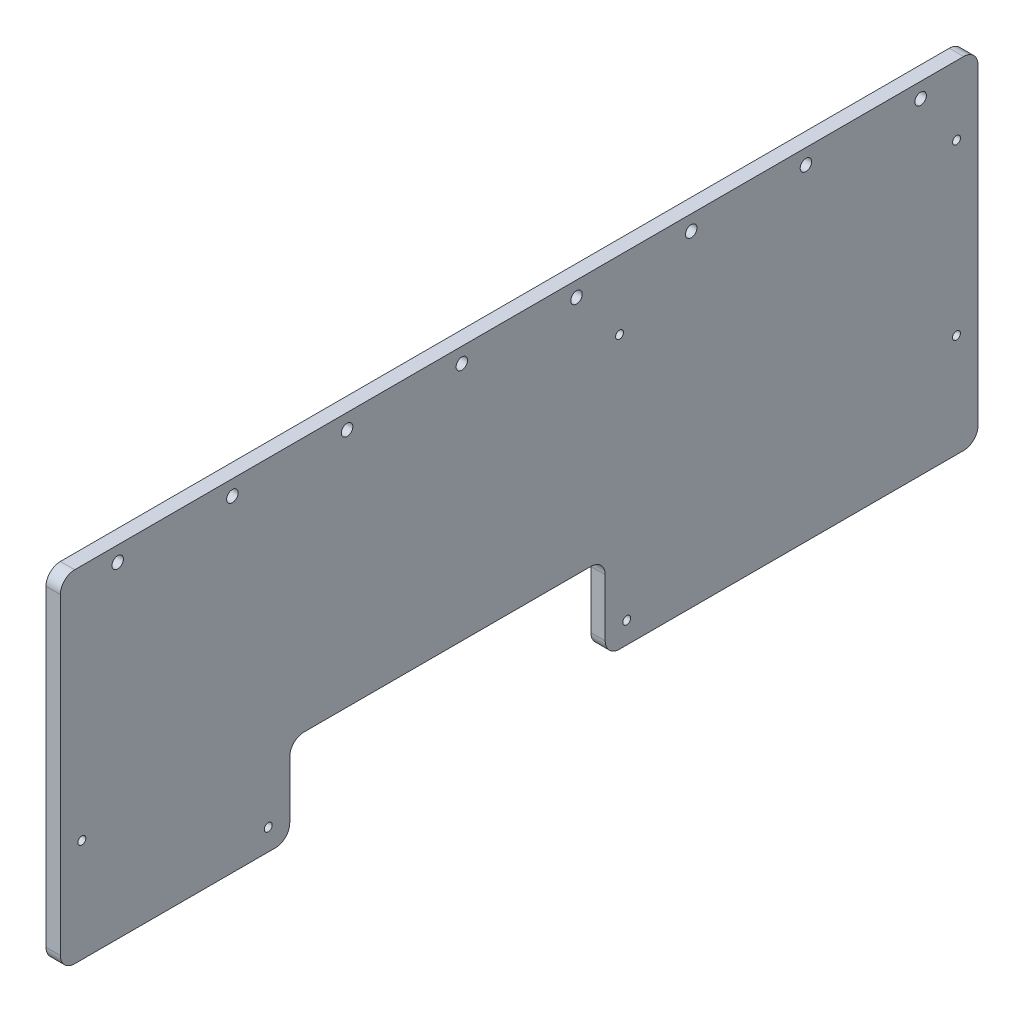
ISO-10303-21;
HEADER;
FILE_DESCRIPTION(('STEP AP214'),'2;1');
FILE_NAME('part.step','',(''),(''),'','','');
FILE_SCHEMA(('AUTOMOTIVE_DESIGN { 1 0 10303 214 1 1 1 1 }'));
ENDSEC;
DATA;
#1=APPLICATION_CONTEXT('core data for automotive mechanical design processes');
#2=APPLICATION_PROTOCOL_DEFINITION('international standard','automotive_design',2000,#1);
#3=PRODUCT_CONTEXT('',#1,'mechanical');
#4=PRODUCT('Part','Part','',(#3));
#5=PRODUCT_RELATED_PRODUCT_CATEGORY('part','',(#4));
#6=PRODUCT_DEFINITION_FORMATION('','',#4);
#7=PRODUCT_DEFINITION_CONTEXT('part definition',#1,'design');
#8=PRODUCT_DEFINITION('design','',#6,#7);
#9=PRODUCT_DEFINITION_SHAPE('','',#8);
#10=(LENGTH_UNIT() NAMED_UNIT(*) SI_UNIT(.MILLI.,.METRE.));
#11=(NAMED_UNIT(*) PLANE_ANGLE_UNIT() SI_UNIT($,.RADIAN.));
#12=(NAMED_UNIT(*) SI_UNIT($,.STERADIAN.) SOLID_ANGLE_UNIT());
#13=UNCERTAINTY_MEASURE_WITH_UNIT(LENGTH_MEASURE(1.E-05),#10,'distance_accuracy_value','');
#14=(GEOMETRIC_REPRESENTATION_CONTEXT(3) GLOBAL_UNCERTAINTY_ASSIGNED_CONTEXT((#13)) GLOBAL_UNIT_ASSIGNED_CONTEXT((#10,
#11,#12)) REPRESENTATION_CONTEXT('',''));
#15=CARTESIAN_POINT('',(0.,0.,0.));
#16=DIRECTION('',(0.,0.,1.));
#17=DIRECTION('',(1.,0.,0.));
#18=AXIS2_PLACEMENT_3D('',#15,#16,#17);
#19=CARTESIAN_POINT('',(0.,163.83,-419.1));
#20=DIRECTION('',(0.,1.,0.));
#21=DIRECTION('',(0.,0.,1.));
#22=AXIS2_PLACEMENT_3D('',#19,#20,#21);
#23=PLANE('',#22);
#24=DIRECTION('',(0.,0.,1.));
#25=VECTOR('',#24,1.);
#26=CARTESIAN_POINT('',(0.,163.83,-419.1));
#27=LINE('',#26,#25);
#28=CARTESIAN_POINT('',(0.,163.83,-412.75));
#29=VERTEX_POINT('',#28);
#30=CARTESIAN_POINT('',(0.,163.83,-19.05));
#31=VERTEX_POINT('',#30);
#32=EDGE_CURVE('E286',#29,#31,#27,.T.);
#33=ORIENTED_EDGE('',*,*,#32,.T.);
#34=DIRECTION('',(1.,0.,0.));
#35=VECTOR('',#34,1.);
#36=CARTESIAN_POINT('',(0.,163.83,-19.05));
#37=LINE('',#36,#35);
#38=CARTESIAN_POINT('',(6.35,163.83,-19.05));
#39=VERTEX_POINT('',#38);
#40=EDGE_CURVE('E168',#31,#39,#37,.T.);
#41=ORIENTED_EDGE('',*,*,#40,.T.);
#42=DIRECTION('',(0.,0.,1.));
#43=VECTOR('',#42,1.);
#44=CARTESIAN_POINT('',(6.35,163.83,-419.1));
#45=LINE('',#44,#43);
#46=CARTESIAN_POINT('',(6.35,163.83,-412.75));
#47=VERTEX_POINT('',#46);
#48=EDGE_CURVE('E152',#47,#39,#45,.T.);
#49=ORIENTED_EDGE('',*,*,#48,.F.);
#50=DIRECTION('',(1.,0.,0.));
#51=VECTOR('',#50,1.);
#52=CARTESIAN_POINT('',(0.,163.83,-412.75));
#53=LINE('',#52,#51);
#54=EDGE_CURVE('E165',#47,#29,#53,.F.);
#55=ORIENTED_EDGE('',*,*,#54,.T.);
#56=EDGE_LOOP('',(#33,#41,#49,#55));
#57=FACE_BOUND('',#56,.T.);
#58=ADVANCED_FACE('F35',(#57),#23,.T.);
#59=CARTESIAN_POINT('',(0.,12.7,-419.1));
#60=DIRECTION('',(0.,0.,-1.));
#61=DIRECTION('',(-1.,0.,0.));
#62=AXIS2_PLACEMENT_3D('',#59,#60,#61);
#63=PLANE('',#62);
#64=DIRECTION('',(0.,1.,0.));
#65=VECTOR('',#64,1.);
#66=CARTESIAN_POINT('',(0.,12.7,-419.1));
#67=LINE('',#66,#65);
#68=CARTESIAN_POINT('',(0.,19.05,-419.1));
#69=VERTEX_POINT('',#68);
#70=CARTESIAN_POINT('',(0.,157.48,-419.1));
#71=VERTEX_POINT('',#70);
#72=EDGE_CURVE('E175',#69,#71,#67,.T.);
#73=ORIENTED_EDGE('',*,*,#72,.T.);
#74=DIRECTION('',(1.,0.,0.));
#75=VECTOR('',#74,1.);
#76=CARTESIAN_POINT('',(0.,157.48,-419.1));
#77=LINE('',#76,#75);
#78=CARTESIAN_POINT('',(6.35,157.48,-419.1));
#79=VERTEX_POINT('',#78);
#80=EDGE_CURVE('E209',#71,#79,#77,.T.);
#81=ORIENTED_EDGE('',*,*,#80,.T.);
#82=DIRECTION('',(0.,1.,0.));
#83=VECTOR('',#82,1.);
#84=CARTESIAN_POINT('',(6.35,12.7,-419.1));
#85=LINE('',#84,#83);
#86=CARTESIAN_POINT('',(6.35,19.05,-419.1));
#87=VERTEX_POINT('',#86);
#88=EDGE_CURVE('E154',#87,#79,#85,.T.);
#89=ORIENTED_EDGE('',*,*,#88,.F.);
#90=DIRECTION('',(1.,0.,0.));
#91=VECTOR('',#90,1.);
#92=CARTESIAN_POINT('',(0.,19.05,-419.1));
#93=LINE('',#92,#91);
#94=EDGE_CURVE('E207',#87,#69,#93,.F.);
#95=ORIENTED_EDGE('',*,*,#94,.T.);
#96=EDGE_LOOP('',(#73,#81,#89,#95));
#97=FACE_BOUND('',#96,.T.);
#98=ADVANCED_FACE('F427',(#97),#63,.T.);
#99=CARTESIAN_POINT('',(0.,12.7,-254.));
#100=DIRECTION('',(0.,-1.,0.));
#101=DIRECTION('',(0.,0.,-1.));
#102=AXIS2_PLACEMENT_3D('',#99,#100,#101);
#103=PLANE('',#102);
#104=DIRECTION('',(0.,0.,-1.));
#105=VECTOR('',#104,1.);
#106=CARTESIAN_POINT('',(0.,12.7,-254.));
#107=LINE('',#106,#105);
#108=CARTESIAN_POINT('',(0.,12.7,-260.35));
#109=VERTEX_POINT('',#108);
#110=CARTESIAN_POINT('',(0.,12.7,-412.75));
#111=VERTEX_POINT('',#110);
#112=EDGE_CURVE('E180',#109,#111,#107,.T.);
#113=ORIENTED_EDGE('',*,*,#112,.T.);
#114=DIRECTION('',(1.,0.,0.));
#115=VECTOR('',#114,1.);
#116=CARTESIAN_POINT('',(0.,12.7,-412.75));
#117=LINE('',#116,#115);
#118=CARTESIAN_POINT('',(6.35,12.7,-412.75));
#119=VERTEX_POINT('',#118);
#120=EDGE_CURVE('E213',#111,#119,#117,.T.);
#121=ORIENTED_EDGE('',*,*,#120,.T.);
#122=DIRECTION('',(0.,0.,-1.));
#123=VECTOR('',#122,1.);
#124=CARTESIAN_POINT('',(6.35,12.7,-254.));
#125=LINE('',#124,#123);
#126=CARTESIAN_POINT('',(6.35,12.7,-260.35));
#127=VERTEX_POINT('',#126);
#128=EDGE_CURVE('E283',#127,#119,#125,.T.);
#129=ORIENTED_EDGE('',*,*,#128,.F.);
#130=DIRECTION('',(1.,0.,0.));
#131=VECTOR('',#130,1.);
#132=CARTESIAN_POINT('',(0.,12.7,-260.35));
#133=LINE('',#132,#131);
#134=EDGE_CURVE('E211',#127,#109,#133,.F.);
#135=ORIENTED_EDGE('',*,*,#134,.T.);
#136=EDGE_LOOP('',(#113,#121,#129,#135));
#137=FACE_BOUND('',#136,.T.);
#138=ADVANCED_FACE('F432',(#137),#103,.T.);
#139=CARTESIAN_POINT('',(0.,50.8,-254.));
#140=DIRECTION('',(0.,0.,1.));
#141=DIRECTION('',(1.,0.,0.));
#142=AXIS2_PLACEMENT_3D('',#139,#140,#141);
#143=PLANE('',#142);
#144=DIRECTION('',(0.,-1.,0.));
#145=VECTOR('',#144,1.);
#146=CARTESIAN_POINT('',(6.35,50.8,-254.));
#147=LINE('',#146,#145);
#148=CARTESIAN_POINT('',(6.35,44.45,-254.));
#149=VERTEX_POINT('',#148);
#150=CARTESIAN_POINT('',(6.35,19.05,-254.));
#151=VERTEX_POINT('',#150);
#152=EDGE_CURVE('E252',#149,#151,#147,.T.);
#153=ORIENTED_EDGE('',*,*,#152,.F.);
#154=DIRECTION('',(1.,0.,0.));
#155=VECTOR('',#154,1.);
#156=CARTESIAN_POINT('',(0.,44.45,-254.));
#157=LINE('',#156,#155);
#158=CARTESIAN_POINT('',(0.,44.45,-254.));
#159=VERTEX_POINT('',#158);
#160=EDGE_CURVE('E224',#149,#159,#157,.F.);
#161=ORIENTED_EDGE('',*,*,#160,.T.);
#162=DIRECTION('',(0.,-1.,0.));
#163=VECTOR('',#162,1.);
#164=CARTESIAN_POINT('',(0.,50.8,-254.));
#165=LINE('',#164,#163);
#166=CARTESIAN_POINT('',(0.,19.05,-254.));
#167=VERTEX_POINT('',#166);
#168=EDGE_CURVE('E266',#159,#167,#165,.T.);
#169=ORIENTED_EDGE('',*,*,#168,.T.);
#170=DIRECTION('',(1.,0.,0.));
#171=VECTOR('',#170,1.);
#172=CARTESIAN_POINT('',(0.,19.05,-254.));
#173=LINE('',#172,#171);
#174=EDGE_CURVE('E221',#167,#151,#173,.T.);
#175=ORIENTED_EDGE('',*,*,#174,.T.);
#176=EDGE_LOOP('',(#153,#161,#169,#175));
#177=FACE_BOUND('',#176,.T.);
#178=ADVANCED_FACE('F485',(#177),#143,.T.);
#179=CARTESIAN_POINT('',(0.,50.8,-114.3));
#180=DIRECTION('',(0.,-1.,0.));
#181=DIRECTION('',(0.,0.,-1.));
#182=AXIS2_PLACEMENT_3D('',#179,#180,#181);
#183=PLANE('',#182);
#184=DIRECTION('',(0.,0.,-1.));
#185=VECTOR('',#184,1.);
#186=CARTESIAN_POINT('',(0.,50.8,-114.3));
#187=LINE('',#186,#185);
#188=CARTESIAN_POINT('',(0.,50.8,-120.65));
#189=VERTEX_POINT('',#188);
#190=CARTESIAN_POINT('',(0.,50.8,-247.65));
#191=VERTEX_POINT('',#190);
#192=EDGE_CURVE('E260',#189,#191,#187,.T.);
#193=ORIENTED_EDGE('',*,*,#192,.T.);
#194=DIRECTION('',(1.,0.,0.));
#195=VECTOR('',#194,1.);
#196=CARTESIAN_POINT('',(6.35,50.8,-247.65));
#197=LINE('',#196,#195);
#198=CARTESIAN_POINT('',(6.35,50.8,-247.65));
#199=VERTEX_POINT('',#198);
#200=EDGE_CURVE('E218',#191,#199,#197,.T.);
#201=ORIENTED_EDGE('',*,*,#200,.T.);
#202=DIRECTION('',(0.,0.,-1.));
#203=VECTOR('',#202,1.);
#204=CARTESIAN_POINT('',(6.35,50.8,-114.3));
#205=LINE('',#204,#203);
#206=CARTESIAN_POINT('',(6.35,50.8,-120.65));
#207=VERTEX_POINT('',#206);
#208=EDGE_CURVE('E241',#207,#199,#205,.T.);
#209=ORIENTED_EDGE('',*,*,#208,.F.);
#210=DIRECTION('',(1.,0.,0.));
#211=VECTOR('',#210,1.);
#212=CARTESIAN_POINT('',(0.,50.8,-120.65));
#213=LINE('',#212,#211);
#214=EDGE_CURVE('E216',#207,#189,#213,.F.);
#215=ORIENTED_EDGE('',*,*,#214,.T.);
#216=EDGE_LOOP('',(#193,#201,#209,#215));
#217=FACE_BOUND('',#216,.T.);
#218=ADVANCED_FACE('F249',(#217),#183,.T.);
#219=CARTESIAN_POINT('',(0.,12.7,-114.3));
#220=DIRECTION('',(0.,0.,-1.));
#221=DIRECTION('',(0.,1.,0.));
#222=AXIS2_PLACEMENT_3D('',#219,#220,#221);
#223=PLANE('',#222);
#224=DIRECTION('',(0.,1.,0.));
#225=VECTOR('',#224,1.);
#226=CARTESIAN_POINT('',(0.,12.7,-114.3));
#227=LINE('',#226,#225);
#228=CARTESIAN_POINT('',(0.,19.05,-114.3));
#229=VERTEX_POINT('',#228);
#230=CARTESIAN_POINT('',(0.,44.45,-114.3));
#231=VERTEX_POINT('',#230);
#232=EDGE_CURVE('E259',#229,#231,#227,.T.);
#233=ORIENTED_EDGE('',*,*,#232,.T.);
#234=DIRECTION('',(1.,0.,0.));
#235=VECTOR('',#234,1.);
#236=CARTESIAN_POINT('',(6.35,44.45,-114.3));
#237=LINE('',#236,#235);
#238=CARTESIAN_POINT('',(6.35,44.45,-114.3));
#239=VERTEX_POINT('',#238);
#240=EDGE_CURVE('E228',#231,#239,#237,.T.);
#241=ORIENTED_EDGE('',*,*,#240,.T.);
#242=DIRECTION('',(0.,1.,0.));
#243=VECTOR('',#242,1.);
#244=CARTESIAN_POINT('',(6.35,12.7,-114.3));
#245=LINE('',#244,#243);
#246=CARTESIAN_POINT('',(6.35,19.05,-114.3));
#247=VERTEX_POINT('',#246);
#248=EDGE_CURVE('E243',#247,#239,#245,.T.);
#249=ORIENTED_EDGE('',*,*,#248,.F.);
#250=DIRECTION('',(1.,0.,0.));
#251=VECTOR('',#250,1.);
#252=CARTESIAN_POINT('',(0.,19.05,-114.3));
#253=LINE('',#252,#251);
#254=EDGE_CURVE('E226',#247,#229,#253,.F.);
#255=ORIENTED_EDGE('',*,*,#254,.T.);
#256=EDGE_LOOP('',(#233,#241,#249,#255));
#257=FACE_BOUND('',#256,.T.);
#258=ADVANCED_FACE('F262',(#257),#223,.T.);
#259=CARTESIAN_POINT('',(0.,12.7,-12.7));
#260=DIRECTION('',(0.,-1.,0.));
#261=DIRECTION('',(0.,0.,-1.));
#262=AXIS2_PLACEMENT_3D('',#259,#260,#261);
#263=PLANE('',#262);
#264=DIRECTION('',(0.,0.,-1.));
#265=VECTOR('',#264,1.);
#266=CARTESIAN_POINT('',(0.,12.7,-12.7));
#267=LINE('',#266,#265);
#268=CARTESIAN_POINT('',(0.,12.7,-19.05));
#269=VERTEX_POINT('',#268);
#270=CARTESIAN_POINT('',(0.,12.7,-107.95));
#271=VERTEX_POINT('',#270);
#272=EDGE_CURVE('E264',#269,#271,#267,.T.);
#273=ORIENTED_EDGE('',*,*,#272,.T.);
#274=DIRECTION('',(1.,0.,0.));
#275=VECTOR('',#274,1.);
#276=CARTESIAN_POINT('',(0.,12.7,-107.95));
#277=LINE('',#276,#275);
#278=CARTESIAN_POINT('',(6.35,12.7,-107.95));
#279=VERTEX_POINT('',#278);
#280=EDGE_CURVE('E232',#271,#279,#277,.T.);
#281=ORIENTED_EDGE('',*,*,#280,.T.);
#282=DIRECTION('',(0.,0.,-1.));
#283=VECTOR('',#282,1.);
#284=CARTESIAN_POINT('',(6.35,12.7,-12.7));
#285=LINE('',#284,#283);
#286=CARTESIAN_POINT('',(6.35,12.7,-19.05));
#287=VERTEX_POINT('',#286);
#288=EDGE_CURVE('E278',#287,#279,#285,.T.);
#289=ORIENTED_EDGE('',*,*,#288,.F.);
#290=DIRECTION('',(1.,0.,0.));
#291=VECTOR('',#290,1.);
#292=CARTESIAN_POINT('',(0.,12.7,-19.05));
#293=LINE('',#292,#291);
#294=EDGE_CURVE('E57',#287,#269,#293,.F.);
#295=ORIENTED_EDGE('',*,*,#294,.T.);
#296=EDGE_LOOP('',(#273,#281,#289,#295));
#297=FACE_BOUND('',#296,.T.);
#298=ADVANCED_FACE('F465',(#297),#263,.T.);
#299=CARTESIAN_POINT('',(0.,163.83,-12.7));
#300=DIRECTION('',(0.,0.,1.));
#301=DIRECTION('',(0.,-1.,0.));
#302=AXIS2_PLACEMENT_3D('',#299,#300,#301);
#303=PLANE('',#302);
#304=DIRECTION('',(0.,-1.,0.));
#305=VECTOR('',#304,1.);
#306=CARTESIAN_POINT('',(6.35,163.83,-12.7));
#307=LINE('',#306,#305);
#308=CARTESIAN_POINT('',(6.35,157.48,-12.7));
#309=VERTEX_POINT('',#308);
#310=CARTESIAN_POINT('',(6.35,19.05,-12.7));
#311=VERTEX_POINT('',#310);
#312=EDGE_CURVE('E169',#309,#311,#307,.T.);
#313=ORIENTED_EDGE('',*,*,#312,.F.);
#314=DIRECTION('',(1.,0.,0.));
#315=VECTOR('',#314,1.);
#316=CARTESIAN_POINT('',(0.,157.48,-12.7));
#317=LINE('',#316,#315);
#318=CARTESIAN_POINT('',(0.,157.48,-12.7));
#319=VERTEX_POINT('',#318);
#320=EDGE_CURVE('E195',#309,#319,#317,.F.);
#321=ORIENTED_EDGE('',*,*,#320,.T.);
#322=DIRECTION('',(0.,-1.,0.));
#323=VECTOR('',#322,1.);
#324=CARTESIAN_POINT('',(0.,163.83,-12.7));
#325=LINE('',#324,#323);
#326=CARTESIAN_POINT('',(0.,19.05,-12.7));
#327=VERTEX_POINT('',#326);
#328=EDGE_CURVE('E268',#319,#327,#325,.T.);
#329=ORIENTED_EDGE('',*,*,#328,.T.);
#330=DIRECTION('',(1.,0.,0.));
#331=VECTOR('',#330,1.);
#332=CARTESIAN_POINT('',(0.,19.05,-12.7));
#333=LINE('',#332,#331);
#334=EDGE_CURVE('E192',#327,#311,#333,.T.);
#335=ORIENTED_EDGE('',*,*,#334,.T.);
#336=EDGE_LOOP('',(#313,#321,#329,#335));
#337=FACE_BOUND('',#336,.T.);
#338=ADVANCED_FACE('F437',(#337),#303,.T.);
#339=CARTESIAN_POINT('',(0.,0.,0.));
#340=DIRECTION('',(1.,0.,0.));
#341=DIRECTION('',(0.,0.,-1.));
#342=AXIS2_PLACEMENT_3D('',#339,#340,#341);
#343=PLANE('',#342);
#344=CARTESIAN_POINT('',(0.,133.35,-409.575));
#345=DIRECTION('',(1.,0.,0.));
#346=DIRECTION('',(0.,0.,-1.));
#347=AXIS2_PLACEMENT_3D('',#344,#345,#346);
#348=CIRCLE('',#347,1.74999999999998);
#349=CARTESIAN_POINT('',(0.,133.35,-411.325));
#350=VERTEX_POINT('',#349);
#351=EDGE_CURVE('E365',#350,#350,#348,.T.);
#352=ORIENTED_EDGE('',*,*,#351,.T.);
#353=EDGE_LOOP('',(#352));
#354=FACE_BOUND('',#353,.T.);
#355=CARTESIAN_POINT('',(0.,133.35,-260.35));
#356=DIRECTION('',(1.,0.,0.));
#357=DIRECTION('',(0.,0.,-1.));
#358=AXIS2_PLACEMENT_3D('',#355,#356,#357);
#359=CIRCLE('',#358,1.74999999999998);
#360=CARTESIAN_POINT('',(0.,133.35,-262.1));
#361=VERTEX_POINT('',#360);
#362=EDGE_CURVE('E359',#361,#361,#359,.T.);
#363=ORIENTED_EDGE('',*,*,#362,.T.);
#364=EDGE_LOOP('',(#363));
#365=FACE_BOUND('',#364,.T.);
#366=CARTESIAN_POINT('',(0.,58.42,-409.575));
#367=DIRECTION('',(1.,0.,0.));
#368=DIRECTION('',(0.,0.,-1.));
#369=AXIS2_PLACEMENT_3D('',#366,#367,#368);
#370=CIRCLE('',#369,1.74999999999998);
#371=CARTESIAN_POINT('',(0.,58.42,-411.325));
#372=VERTEX_POINT('',#371);
#373=EDGE_CURVE('E353',#372,#372,#370,.T.);
#374=ORIENTED_EDGE('',*,*,#373,.T.);
#375=EDGE_LOOP('',(#374));
#376=FACE_BOUND('',#375,.T.);
#377=CARTESIAN_POINT('',(0.,22.225,-263.525));
#378=DIRECTION('',(1.,0.,0.));
#379=DIRECTION('',(0.,0.,-1.));
#380=AXIS2_PLACEMENT_3D('',#377,#378,#379);
#381=CIRCLE('',#380,1.74999999999998);
#382=CARTESIAN_POINT('',(0.,22.225,-265.275));
#383=VERTEX_POINT('',#382);
#384=EDGE_CURVE('E347',#383,#383,#381,.T.);
#385=ORIENTED_EDGE('',*,*,#384,.T.);
#386=EDGE_LOOP('',(#385));
#387=FACE_BOUND('',#386,.T.);
#388=CARTESIAN_POINT('',(0.,22.225,-104.775));
#389=DIRECTION('',(1.,0.,0.));
#390=DIRECTION('',(0.,0.,-1.));
#391=AXIS2_PLACEMENT_3D('',#388,#389,#390);
#392=CIRCLE('',#391,1.75);
#393=CARTESIAN_POINT('',(0.,22.225,-106.525));
#394=VERTEX_POINT('',#393);
#395=EDGE_CURVE('E341',#394,#394,#392,.T.);
#396=ORIENTED_EDGE('',*,*,#395,.T.);
#397=EDGE_LOOP('',(#396));
#398=FACE_BOUND('',#397,.T.);
#399=CARTESIAN_POINT('',(0.,58.42,-22.225));
#400=DIRECTION('',(1.,0.,0.));
#401=DIRECTION('',(0.,0.,-1.));
#402=AXIS2_PLACEMENT_3D('',#399,#400,#401);
#403=CIRCLE('',#402,1.75);
#404=CARTESIAN_POINT('',(0.,58.42,-23.975));
#405=VERTEX_POINT('',#404);
#406=EDGE_CURVE('E335',#405,#405,#403,.T.);
#407=ORIENTED_EDGE('',*,*,#406,.T.);
#408=EDGE_LOOP('',(#407));
#409=FACE_BOUND('',#408,.T.);
#410=CARTESIAN_POINT('',(0.,157.1625,-393.7));
#411=DIRECTION('',(1.,0.,0.));
#412=DIRECTION('',(0.,0.,-1.));
#413=AXIS2_PLACEMENT_3D('',#410,#411,#412);
#414=CIRCLE('',#413,2.54000000000001);
#415=CARTESIAN_POINT('',(0.,157.1625,-396.24));
#416=VERTEX_POINT('',#415);
#417=EDGE_CURVE('E329',#416,#416,#414,.T.);
#418=ORIENTED_EDGE('',*,*,#417,.T.);
#419=EDGE_LOOP('',(#418));
#420=FACE_BOUND('',#419,.T.);
#421=CARTESIAN_POINT('',(0.,157.1625,-342.9));
#422=DIRECTION('',(1.,0.,0.));
#423=DIRECTION('',(0.,0.,-1.));
#424=AXIS2_PLACEMENT_3D('',#421,#422,#423);
#425=CIRCLE('',#424,2.54000000000001);
#426=CARTESIAN_POINT('',(0.,157.1625,-345.44));
#427=VERTEX_POINT('',#426);
#428=EDGE_CURVE('E323',#427,#427,#425,.T.);
#429=ORIENTED_EDGE('',*,*,#428,.T.);
#430=EDGE_LOOP('',(#429));
#431=FACE_BOUND('',#430,.T.);
#432=CARTESIAN_POINT('',(0.,157.1625,-292.1));
#433=DIRECTION('',(1.,0.,0.));
#434=DIRECTION('',(0.,0.,-1.));
#435=AXIS2_PLACEMENT_3D('',#432,#433,#434);
#436=CIRCLE('',#435,2.54000000000001);
#437=CARTESIAN_POINT('',(0.,157.1625,-294.64));
#438=VERTEX_POINT('',#437);
#439=EDGE_CURVE('E317',#438,#438,#436,.T.);
#440=ORIENTED_EDGE('',*,*,#439,.T.);
#441=EDGE_LOOP('',(#440));
#442=FACE_BOUND('',#441,.T.);
#443=CARTESIAN_POINT('',(0.,157.1625,-241.3));
#444=DIRECTION('',(1.,0.,0.));
#445=DIRECTION('',(0.,0.,-1.));
#446=AXIS2_PLACEMENT_3D('',#443,#444,#445);
#447=CIRCLE('',#446,2.53999999999998);
#448=CARTESIAN_POINT('',(0.,157.1625,-243.84));
#449=VERTEX_POINT('',#448);
#450=EDGE_CURVE('E311',#449,#449,#447,.T.);
#451=ORIENTED_EDGE('',*,*,#450,.T.);
#452=EDGE_LOOP('',(#451));
#453=FACE_BOUND('',#452,.T.);
#454=CARTESIAN_POINT('',(0.,157.1625,-190.5));
#455=DIRECTION('',(1.,0.,0.));
#456=DIRECTION('',(0.,0.,-1.));
#457=AXIS2_PLACEMENT_3D('',#454,#455,#456);
#458=CIRCLE('',#457,2.53999999999998);
#459=CARTESIAN_POINT('',(0.,157.1625,-193.04));
#460=VERTEX_POINT('',#459);
#461=EDGE_CURVE('E305',#460,#460,#458,.T.);
#462=ORIENTED_EDGE('',*,*,#461,.T.);
#463=EDGE_LOOP('',(#462));
#464=FACE_BOUND('',#463,.T.);
#465=CARTESIAN_POINT('',(0.,157.1625,-139.7));
#466=DIRECTION('',(1.,0.,0.));
#467=DIRECTION('',(0.,0.,-1.));
#468=AXIS2_PLACEMENT_3D('',#465,#466,#467);
#469=CIRCLE('',#468,2.53999999999998);
#470=CARTESIAN_POINT('',(0.,157.1625,-142.24));
#471=VERTEX_POINT('',#470);
#472=EDGE_CURVE('E299',#471,#471,#469,.T.);
#473=ORIENTED_EDGE('',*,*,#472,.T.);
#474=EDGE_LOOP('',(#473));
#475=FACE_BOUND('',#474,.T.);
#476=CARTESIAN_POINT('',(0.,157.1625,-88.8999999999999));
#477=DIRECTION('',(1.,0.,0.));
#478=DIRECTION('',(0.,0.,-1.));
#479=AXIS2_PLACEMENT_3D('',#476,#477,#478);
#480=CIRCLE('',#479,2.54);
#481=CARTESIAN_POINT('',(0.,157.1625,-91.4399999999999));
#482=VERTEX_POINT('',#481);
#483=EDGE_CURVE('E293',#482,#482,#480,.T.);
#484=ORIENTED_EDGE('',*,*,#483,.T.);
#485=EDGE_LOOP('',(#484));
#486=FACE_BOUND('',#485,.T.);
#487=CARTESIAN_POINT('',(0.,157.1625,-38.1));
#488=DIRECTION('',(1.,0.,0.));
#489=DIRECTION('',(0.,0.,-1.));
#490=AXIS2_PLACEMENT_3D('',#487,#488,#489);
#491=CIRCLE('',#490,2.54000000000002);
#492=CARTESIAN_POINT('',(0.,157.1625,-40.64));
#493=VERTEX_POINT('',#492);
#494=EDGE_CURVE('E170',#493,#493,#491,.T.);
#495=ORIENTED_EDGE('',*,*,#494,.T.);
#496=EDGE_LOOP('',(#495));
#497=FACE_BOUND('',#496,.T.);
#498=ORIENTED_EDGE('',*,*,#328,.F.);
#499=CARTESIAN_POINT('',(0.,157.48,-19.05));
#500=DIRECTION('',(1.,0.,0.));
#501=DIRECTION('',(0.,0.,-1.));
#502=AXIS2_PLACEMENT_3D('',#499,#500,#501);
#503=CIRCLE('',#502,6.35);
#504=EDGE_CURVE('E205',#319,#31,#503,.F.);
#505=ORIENTED_EDGE('',*,*,#504,.T.);
#506=ORIENTED_EDGE('',*,*,#32,.F.);
#507=CARTESIAN_POINT('',(0.,157.48,-412.75));
#508=DIRECTION('',(1.,0.,0.));
#509=DIRECTION('',(0.,0.,-1.));
#510=AXIS2_PLACEMENT_3D('',#507,#508,#509);
#511=CIRCLE('',#510,6.35);
#512=EDGE_CURVE('E174',#29,#71,#511,.F.);
#513=ORIENTED_EDGE('',*,*,#512,.T.);
#514=ORIENTED_EDGE('',*,*,#72,.F.);
#515=CARTESIAN_POINT('',(0.,19.05,-412.75));
#516=DIRECTION('',(1.,0.,0.));
#517=DIRECTION('',(0.,0.,-1.));
#518=AXIS2_PLACEMENT_3D('',#515,#516,#517);
#519=CIRCLE('',#518,6.35);
#520=EDGE_CURVE('E202',#69,#111,#519,.F.);
#521=ORIENTED_EDGE('',*,*,#520,.T.);
#522=ORIENTED_EDGE('',*,*,#112,.F.);
#523=CARTESIAN_POINT('',(0.,19.05,-260.35));
#524=DIRECTION('',(1.,0.,0.));
#525=DIRECTION('',(0.,0.,-1.));
#526=AXIS2_PLACEMENT_3D('',#523,#524,#525);
#527=CIRCLE('',#526,6.35);
#528=EDGE_CURVE('E200',#109,#167,#527,.F.);
#529=ORIENTED_EDGE('',*,*,#528,.T.);
#530=ORIENTED_EDGE('',*,*,#168,.F.);
#531=CARTESIAN_POINT('',(0.,44.45,-247.65));
#532=DIRECTION('',(1.,0.,0.));
#533=DIRECTION('',(0.,0.,-1.));
#534=AXIS2_PLACEMENT_3D('',#531,#532,#533);
#535=CIRCLE('',#534,6.35);
#536=EDGE_CURVE('E237',#159,#191,#535,.T.);
#537=ORIENTED_EDGE('',*,*,#536,.T.);
#538=ORIENTED_EDGE('',*,*,#192,.F.);
#539=CARTESIAN_POINT('',(0.,44.45,-120.65));
#540=DIRECTION('',(1.,0.,0.));
#541=DIRECTION('',(0.,0.,-1.));
#542=AXIS2_PLACEMENT_3D('',#539,#540,#541);
#543=CIRCLE('',#542,6.35);
#544=EDGE_CURVE('E11',#189,#231,#543,.T.);
#545=ORIENTED_EDGE('',*,*,#544,.T.);
#546=ORIENTED_EDGE('',*,*,#232,.F.);
#547=CARTESIAN_POINT('',(0.,19.05,-107.95));
#548=DIRECTION('',(1.,0.,0.));
#549=DIRECTION('',(0.,0.,-1.));
#550=AXIS2_PLACEMENT_3D('',#547,#548,#549);
#551=CIRCLE('',#550,6.35);
#552=EDGE_CURVE('E50',#229,#271,#551,.F.);
#553=ORIENTED_EDGE('',*,*,#552,.T.);
#554=ORIENTED_EDGE('',*,*,#272,.F.);
#555=CARTESIAN_POINT('',(0.,19.05,-19.05));
#556=DIRECTION('',(1.,0.,0.));
#557=DIRECTION('',(0.,0.,-1.));
#558=AXIS2_PLACEMENT_3D('',#555,#556,#557);
#559=CIRCLE('',#558,6.35);
#560=EDGE_CURVE('E197',#269,#327,#559,.F.);
#561=ORIENTED_EDGE('',*,*,#560,.T.);
#562=EDGE_LOOP('',(#498,#505,#506,#513,#514,#521,#522,#529,#530,#537,#538,#545,#546,#553,#554,#561));
#563=FACE_BOUND('',#562,.T.);
#564=ADVANCED_FACE('F258',(#354,#365,#376,#387,#398,#409,#420,#431,#442,#453,#464,#475,#486,
#497,#563),#343,.F.);
#565=CARTESIAN_POINT('',(6.35,0.,0.));
#566=DIRECTION('',(1.,0.,0.));
#567=DIRECTION('',(0.,0.,-1.));
#568=AXIS2_PLACEMENT_3D('',#565,#566,#567);
#569=PLANE('',#568);
#570=CARTESIAN_POINT('',(6.35,133.35,-409.575));
#571=DIRECTION('',(1.,0.,0.));
#572=DIRECTION('',(0.,0.,-1.));
#573=AXIS2_PLACEMENT_3D('',#570,#571,#572);
#574=CIRCLE('',#573,1.74999999999998);
#575=CARTESIAN_POINT('',(6.35,133.35,-411.325));
#576=VERTEX_POINT('',#575);
#577=EDGE_CURVE('E368',#576,#576,#574,.T.);
#578=ORIENTED_EDGE('',*,*,#577,.F.);
#579=EDGE_LOOP('',(#578));
#580=FACE_BOUND('',#579,.T.);
#581=CARTESIAN_POINT('',(6.35,133.35,-260.35));
#582=DIRECTION('',(1.,0.,0.));
#583=DIRECTION('',(0.,0.,-1.));
#584=AXIS2_PLACEMENT_3D('',#581,#582,#583);
#585=CIRCLE('',#584,1.74999999999998);
#586=CARTESIAN_POINT('',(6.35,133.35,-262.1));
#587=VERTEX_POINT('',#586);
#588=EDGE_CURVE('E362',#587,#587,#585,.T.);
#589=ORIENTED_EDGE('',*,*,#588,.F.);
#590=EDGE_LOOP('',(#589));
#591=FACE_BOUND('',#590,.T.);
#592=CARTESIAN_POINT('',(6.35,58.42,-409.575));
#593=DIRECTION('',(1.,0.,0.));
#594=DIRECTION('',(0.,0.,-1.));
#595=AXIS2_PLACEMENT_3D('',#592,#593,#594);
#596=CIRCLE('',#595,1.74999999999998);
#597=CARTESIAN_POINT('',(6.35,58.42,-411.325));
#598=VERTEX_POINT('',#597);
#599=EDGE_CURVE('E356',#598,#598,#596,.T.);
#600=ORIENTED_EDGE('',*,*,#599,.F.);
#601=EDGE_LOOP('',(#600));
#602=FACE_BOUND('',#601,.T.);
#603=CARTESIAN_POINT('',(6.35,22.225,-263.525));
#604=DIRECTION('',(1.,0.,0.));
#605=DIRECTION('',(0.,0.,-1.));
#606=AXIS2_PLACEMENT_3D('',#603,#604,#605);
#607=CIRCLE('',#606,1.74999999999998);
#608=CARTESIAN_POINT('',(6.35,22.225,-265.275));
#609=VERTEX_POINT('',#608);
#610=EDGE_CURVE('E350',#609,#609,#607,.T.);
#611=ORIENTED_EDGE('',*,*,#610,.F.);
#612=EDGE_LOOP('',(#611));
#613=FACE_BOUND('',#612,.T.);
#614=CARTESIAN_POINT('',(6.35,22.225,-104.775));
#615=DIRECTION('',(1.,0.,0.));
#616=DIRECTION('',(0.,0.,-1.));
#617=AXIS2_PLACEMENT_3D('',#614,#615,#616);
#618=CIRCLE('',#617,1.75);
#619=CARTESIAN_POINT('',(6.35,22.225,-106.525));
#620=VERTEX_POINT('',#619);
#621=EDGE_CURVE('E344',#620,#620,#618,.T.);
#622=ORIENTED_EDGE('',*,*,#621,.F.);
#623=EDGE_LOOP('',(#622));
#624=FACE_BOUND('',#623,.T.);
#625=CARTESIAN_POINT('',(6.35,58.42,-22.225));
#626=DIRECTION('',(1.,0.,0.));
#627=DIRECTION('',(0.,0.,-1.));
#628=AXIS2_PLACEMENT_3D('',#625,#626,#627);
#629=CIRCLE('',#628,1.75);
#630=CARTESIAN_POINT('',(6.35,58.42,-23.975));
#631=VERTEX_POINT('',#630);
#632=EDGE_CURVE('E338',#631,#631,#629,.T.);
#633=ORIENTED_EDGE('',*,*,#632,.F.);
#634=EDGE_LOOP('',(#633));
#635=FACE_BOUND('',#634,.T.);
#636=CARTESIAN_POINT('',(6.35,157.1625,-393.7));
#637=DIRECTION('',(1.,0.,0.));
#638=DIRECTION('',(0.,0.,-1.));
#639=AXIS2_PLACEMENT_3D('',#636,#637,#638);
#640=CIRCLE('',#639,2.54000000000001);
#641=CARTESIAN_POINT('',(6.35,157.1625,-396.24));
#642=VERTEX_POINT('',#641);
#643=EDGE_CURVE('E332',#642,#642,#640,.T.);
#644=ORIENTED_EDGE('',*,*,#643,.F.);
#645=EDGE_LOOP('',(#644));
#646=FACE_BOUND('',#645,.T.);
#647=CARTESIAN_POINT('',(6.35,157.1625,-342.9));
#648=DIRECTION('',(1.,0.,0.));
#649=DIRECTION('',(0.,0.,-1.));
#650=AXIS2_PLACEMENT_3D('',#647,#648,#649);
#651=CIRCLE('',#650,2.54000000000001);
#652=CARTESIAN_POINT('',(6.35,157.1625,-345.44));
#653=VERTEX_POINT('',#652);
#654=EDGE_CURVE('E326',#653,#653,#651,.T.);
#655=ORIENTED_EDGE('',*,*,#654,.F.);
#656=EDGE_LOOP('',(#655));
#657=FACE_BOUND('',#656,.T.);
#658=CARTESIAN_POINT('',(6.35,157.1625,-292.1));
#659=DIRECTION('',(1.,0.,0.));
#660=DIRECTION('',(0.,0.,-1.));
#661=AXIS2_PLACEMENT_3D('',#658,#659,#660);
#662=CIRCLE('',#661,2.54000000000001);
#663=CARTESIAN_POINT('',(6.35,157.1625,-294.64));
#664=VERTEX_POINT('',#663);
#665=EDGE_CURVE('E320',#664,#664,#662,.T.);
#666=ORIENTED_EDGE('',*,*,#665,.F.);
#667=EDGE_LOOP('',(#666));
#668=FACE_BOUND('',#667,.T.);
#669=CARTESIAN_POINT('',(6.35,157.1625,-241.3));
#670=DIRECTION('',(1.,0.,0.));
#671=DIRECTION('',(0.,0.,-1.));
#672=AXIS2_PLACEMENT_3D('',#669,#670,#671);
#673=CIRCLE('',#672,2.53999999999998);
#674=CARTESIAN_POINT('',(6.35,157.1625,-243.84));
#675=VERTEX_POINT('',#674);
#676=EDGE_CURVE('E314',#675,#675,#673,.T.);
#677=ORIENTED_EDGE('',*,*,#676,.F.);
#678=EDGE_LOOP('',(#677));
#679=FACE_BOUND('',#678,.T.);
#680=CARTESIAN_POINT('',(6.35,157.1625,-190.5));
#681=DIRECTION('',(1.,0.,0.));
#682=DIRECTION('',(0.,0.,-1.));
#683=AXIS2_PLACEMENT_3D('',#680,#681,#682);
#684=CIRCLE('',#683,2.53999999999998);
#685=CARTESIAN_POINT('',(6.35,157.1625,-193.04));
#686=VERTEX_POINT('',#685);
#687=EDGE_CURVE('E308',#686,#686,#684,.T.);
#688=ORIENTED_EDGE('',*,*,#687,.F.);
#689=EDGE_LOOP('',(#688));
#690=FACE_BOUND('',#689,.T.);
#691=CARTESIAN_POINT('',(6.35,157.1625,-139.7));
#692=DIRECTION('',(1.,0.,0.));
#693=DIRECTION('',(0.,0.,-1.));
#694=AXIS2_PLACEMENT_3D('',#691,#692,#693);
#695=CIRCLE('',#694,2.53999999999998);
#696=CARTESIAN_POINT('',(6.35,157.1625,-142.24));
#697=VERTEX_POINT('',#696);
#698=EDGE_CURVE('E302',#697,#697,#695,.T.);
#699=ORIENTED_EDGE('',*,*,#698,.F.);
#700=EDGE_LOOP('',(#699));
#701=FACE_BOUND('',#700,.T.);
#702=CARTESIAN_POINT('',(6.35,157.1625,-88.8999999999999));
#703=DIRECTION('',(1.,0.,0.));
#704=DIRECTION('',(0.,0.,-1.));
#705=AXIS2_PLACEMENT_3D('',#702,#703,#704);
#706=CIRCLE('',#705,2.54);
#707=CARTESIAN_POINT('',(6.35,157.1625,-91.4399999999999));
#708=VERTEX_POINT('',#707);
#709=EDGE_CURVE('E296',#708,#708,#706,.T.);
#710=ORIENTED_EDGE('',*,*,#709,.F.);
#711=EDGE_LOOP('',(#710));
#712=FACE_BOUND('',#711,.T.);
#713=CARTESIAN_POINT('',(6.35,157.1625,-38.1));
#714=DIRECTION('',(1.,0.,0.));
#715=DIRECTION('',(0.,0.,-1.));
#716=AXIS2_PLACEMENT_3D('',#713,#714,#715);
#717=CIRCLE('',#716,2.54000000000002);
#718=CARTESIAN_POINT('',(6.35,157.1625,-40.64));
#719=VERTEX_POINT('',#718);
#720=EDGE_CURVE('E290',#719,#719,#717,.T.);
#721=ORIENTED_EDGE('',*,*,#720,.F.);
#722=EDGE_LOOP('',(#721));
#723=FACE_BOUND('',#722,.T.);
#724=ORIENTED_EDGE('',*,*,#48,.T.);
#725=CARTESIAN_POINT('',(6.35,157.48,-19.05));
#726=DIRECTION('',(1.,0.,0.));
#727=DIRECTION('',(0.,0.,-1.));
#728=AXIS2_PLACEMENT_3D('',#725,#726,#727);
#729=CIRCLE('',#728,6.35);
#730=EDGE_CURVE('E159',#39,#309,#729,.T.);
#731=ORIENTED_EDGE('',*,*,#730,.T.);
#732=ORIENTED_EDGE('',*,*,#312,.T.);
#733=CARTESIAN_POINT('',(6.35,19.05,-19.05));
#734=DIRECTION('',(1.,0.,0.));
#735=DIRECTION('',(0.,0.,-1.));
#736=AXIS2_PLACEMENT_3D('',#733,#734,#735);
#737=CIRCLE('',#736,6.35);
#738=EDGE_CURVE('E177',#311,#287,#737,.T.);
#739=ORIENTED_EDGE('',*,*,#738,.T.);
#740=ORIENTED_EDGE('',*,*,#288,.T.);
#741=CARTESIAN_POINT('',(6.35,19.05,-107.95));
#742=DIRECTION('',(1.,0.,0.));
#743=DIRECTION('',(0.,0.,-1.));
#744=AXIS2_PLACEMENT_3D('',#741,#742,#743);
#745=CIRCLE('',#744,6.35);
#746=EDGE_CURVE('E186',#279,#247,#745,.T.);
#747=ORIENTED_EDGE('',*,*,#746,.T.);
#748=ORIENTED_EDGE('',*,*,#248,.T.);
#749=CARTESIAN_POINT('',(6.35,44.45,-120.65));
#750=DIRECTION('',(1.,0.,0.));
#751=DIRECTION('',(0.,0.,-1.));
#752=AXIS2_PLACEMENT_3D('',#749,#750,#751);
#753=CIRCLE('',#752,6.35);
#754=EDGE_CURVE('E43',#239,#207,#753,.F.);
#755=ORIENTED_EDGE('',*,*,#754,.T.);
#756=ORIENTED_EDGE('',*,*,#208,.T.);
#757=CARTESIAN_POINT('',(6.35,44.45,-247.65));
#758=DIRECTION('',(1.,0.,0.));
#759=DIRECTION('',(0.,0.,-1.));
#760=AXIS2_PLACEMENT_3D('',#757,#758,#759);
#761=CIRCLE('',#760,6.35);
#762=EDGE_CURVE('E235',#199,#149,#761,.F.);
#763=ORIENTED_EDGE('',*,*,#762,.T.);
#764=ORIENTED_EDGE('',*,*,#152,.T.);
#765=CARTESIAN_POINT('',(6.35,19.05,-260.35));
#766=DIRECTION('',(1.,0.,0.));
#767=DIRECTION('',(0.,0.,-1.));
#768=AXIS2_PLACEMENT_3D('',#765,#766,#767);
#769=CIRCLE('',#768,6.35);
#770=EDGE_CURVE('E188',#151,#127,#769,.T.);
#771=ORIENTED_EDGE('',*,*,#770,.T.);
#772=ORIENTED_EDGE('',*,*,#128,.T.);
#773=CARTESIAN_POINT('',(6.35,19.05,-412.75));
#774=DIRECTION('',(1.,0.,0.));
#775=DIRECTION('',(0.,0.,-1.));
#776=AXIS2_PLACEMENT_3D('',#773,#774,#775);
#777=CIRCLE('',#776,6.35);
#778=EDGE_CURVE('E160',#119,#87,#777,.T.);
#779=ORIENTED_EDGE('',*,*,#778,.T.);
#780=ORIENTED_EDGE('',*,*,#88,.T.);
#781=CARTESIAN_POINT('',(6.35,157.48,-412.75));
#782=DIRECTION('',(1.,0.,0.));
#783=DIRECTION('',(0.,0.,-1.));
#784=AXIS2_PLACEMENT_3D('',#781,#782,#783);
#785=CIRCLE('',#784,6.35);
#786=EDGE_CURVE('E149',#79,#47,#785,.T.);
#787=ORIENTED_EDGE('',*,*,#786,.T.);
#788=EDGE_LOOP('',(#724,#731,#732,#739,#740,#747,#748,#755,#756,#763,#764,#771,#772,#779,#780,#787));
#789=FACE_BOUND('',#788,.T.);
#790=ADVANCED_FACE('F151',(#580,#591,#602,#613,#624,#635,#646,#657,#668,#679,#690,#701,#712,
#723,#789),#569,.T.);
#791=CARTESIAN_POINT('',(0.,157.1625,-38.1));
#792=DIRECTION('',(1.,0.,0.));
#793=DIRECTION('',(0.,0.,-1.));
#794=AXIS2_PLACEMENT_3D('',#791,#792,#793);
#795=CYLINDRICAL_SURFACE('',#794,2.54000000000002);
#796=ORIENTED_EDGE('',*,*,#494,.F.);
#797=EDGE_LOOP('',(#796));
#798=FACE_BOUND('',#797,.T.);
#799=ORIENTED_EDGE('',*,*,#720,.T.);
#800=EDGE_LOOP('',(#799));
#801=FACE_BOUND('',#800,.T.);
#802=ADVANCED_FACE('F386',(#798,#801),#795,.F.);
#803=CARTESIAN_POINT('',(0.,157.1625,-88.8999999999999));
#804=DIRECTION('',(1.,0.,0.));
#805=DIRECTION('',(0.,0.,-1.));
#806=AXIS2_PLACEMENT_3D('',#803,#804,#805);
#807=CYLINDRICAL_SURFACE('',#806,2.54);
#808=ORIENTED_EDGE('',*,*,#483,.F.);
#809=EDGE_LOOP('',(#808));
#810=FACE_BOUND('',#809,.T.);
#811=ORIENTED_EDGE('',*,*,#709,.T.);
#812=EDGE_LOOP('',(#811));
#813=FACE_BOUND('',#812,.T.);
#814=ADVANCED_FACE('F415',(#810,#813),#807,.F.);
#815=CARTESIAN_POINT('',(0.,157.1625,-139.7));
#816=DIRECTION('',(1.,0.,0.));
#817=DIRECTION('',(0.,0.,-1.));
#818=AXIS2_PLACEMENT_3D('',#815,#816,#817);
#819=CYLINDRICAL_SURFACE('',#818,2.53999999999998);
#820=ORIENTED_EDGE('',*,*,#472,.F.);
#821=EDGE_LOOP('',(#820));
#822=FACE_BOUND('',#821,.T.);
#823=ORIENTED_EDGE('',*,*,#698,.T.);
#824=EDGE_LOOP('',(#823));
#825=FACE_BOUND('',#824,.T.);
#826=ADVANCED_FACE('F421',(#822,#825),#819,.F.);
#827=CARTESIAN_POINT('',(0.,157.1625,-190.5));
#828=DIRECTION('',(1.,0.,0.));
#829=DIRECTION('',(0.,0.,-1.));
#830=AXIS2_PLACEMENT_3D('',#827,#828,#829);
#831=CYLINDRICAL_SURFACE('',#830,2.53999999999998);
#832=ORIENTED_EDGE('',*,*,#461,.F.);
#833=EDGE_LOOP('',(#832));
#834=FACE_BOUND('',#833,.T.);
#835=ORIENTED_EDGE('',*,*,#687,.T.);
#836=EDGE_LOOP('',(#835));
#837=FACE_BOUND('',#836,.T.);
#838=ADVANCED_FACE('F633',(#834,#837),#831,.F.);
#839=CARTESIAN_POINT('',(0.,157.1625,-241.3));
#840=DIRECTION('',(1.,0.,0.));
#841=DIRECTION('',(0.,0.,-1.));
#842=AXIS2_PLACEMENT_3D('',#839,#840,#841);
#843=CYLINDRICAL_SURFACE('',#842,2.53999999999998);
#844=ORIENTED_EDGE('',*,*,#450,.F.);
#845=EDGE_LOOP('',(#844));
#846=FACE_BOUND('',#845,.T.);
#847=ORIENTED_EDGE('',*,*,#676,.T.);
#848=EDGE_LOOP('',(#847));
#849=FACE_BOUND('',#848,.T.);
#850=ADVANCED_FACE('F625',(#846,#849),#843,.F.);
#851=CARTESIAN_POINT('',(0.,157.1625,-292.1));
#852=DIRECTION('',(1.,0.,0.));
#853=DIRECTION('',(0.,0.,-1.));
#854=AXIS2_PLACEMENT_3D('',#851,#852,#853);
#855=CYLINDRICAL_SURFACE('',#854,2.54000000000001);
#856=ORIENTED_EDGE('',*,*,#439,.F.);
#857=EDGE_LOOP('',(#856));
#858=FACE_BOUND('',#857,.T.);
#859=ORIENTED_EDGE('',*,*,#665,.T.);
#860=EDGE_LOOP('',(#859));
#861=FACE_BOUND('',#860,.T.);
#862=ADVANCED_FACE('F617',(#858,#861),#855,.F.);
#863=CARTESIAN_POINT('',(0.,157.1625,-342.9));
#864=DIRECTION('',(1.,0.,0.));
#865=DIRECTION('',(0.,0.,-1.));
#866=AXIS2_PLACEMENT_3D('',#863,#864,#865);
#867=CYLINDRICAL_SURFACE('',#866,2.54000000000001);
#868=ORIENTED_EDGE('',*,*,#428,.F.);
#869=EDGE_LOOP('',(#868));
#870=FACE_BOUND('',#869,.T.);
#871=ORIENTED_EDGE('',*,*,#654,.T.);
#872=EDGE_LOOP('',(#871));
#873=FACE_BOUND('',#872,.T.);
#874=ADVANCED_FACE('F609',(#870,#873),#867,.F.);
#875=CARTESIAN_POINT('',(0.,157.1625,-393.7));
#876=DIRECTION('',(1.,0.,0.));
#877=DIRECTION('',(0.,0.,-1.));
#878=AXIS2_PLACEMENT_3D('',#875,#876,#877);
#879=CYLINDRICAL_SURFACE('',#878,2.54000000000001);
#880=ORIENTED_EDGE('',*,*,#417,.F.);
#881=EDGE_LOOP('',(#880));
#882=FACE_BOUND('',#881,.T.);
#883=ORIENTED_EDGE('',*,*,#643,.T.);
#884=EDGE_LOOP('',(#883));
#885=FACE_BOUND('',#884,.T.);
#886=ADVANCED_FACE('F601',(#882,#885),#879,.F.);
#887=CARTESIAN_POINT('',(0.,58.42,-22.225));
#888=DIRECTION('',(1.,0.,0.));
#889=DIRECTION('',(0.,0.,-1.));
#890=AXIS2_PLACEMENT_3D('',#887,#888,#889);
#891=CYLINDRICAL_SURFACE('',#890,1.75);
#892=ORIENTED_EDGE('',*,*,#406,.F.);
#893=EDGE_LOOP('',(#892));
#894=FACE_BOUND('',#893,.T.);
#895=ORIENTED_EDGE('',*,*,#632,.T.);
#896=EDGE_LOOP('',(#895));
#897=FACE_BOUND('',#896,.T.);
#898=ADVANCED_FACE('F593',(#894,#897),#891,.F.);
#899=CARTESIAN_POINT('',(0.,22.225,-104.775));
#900=DIRECTION('',(1.,0.,0.));
#901=DIRECTION('',(0.,0.,-1.));
#902=AXIS2_PLACEMENT_3D('',#899,#900,#901);
#903=CYLINDRICAL_SURFACE('',#902,1.75);
#904=ORIENTED_EDGE('',*,*,#395,.F.);
#905=EDGE_LOOP('',(#904));
#906=FACE_BOUND('',#905,.T.);
#907=ORIENTED_EDGE('',*,*,#621,.T.);
#908=EDGE_LOOP('',(#907));
#909=FACE_BOUND('',#908,.T.);
#910=ADVANCED_FACE('F585',(#906,#909),#903,.F.);
#911=CARTESIAN_POINT('',(0.,22.225,-263.525));
#912=DIRECTION('',(1.,0.,0.));
#913=DIRECTION('',(0.,0.,-1.));
#914=AXIS2_PLACEMENT_3D('',#911,#912,#913);
#915=CYLINDRICAL_SURFACE('',#914,1.74999999999998);
#916=ORIENTED_EDGE('',*,*,#384,.F.);
#917=EDGE_LOOP('',(#916));
#918=FACE_BOUND('',#917,.T.);
#919=ORIENTED_EDGE('',*,*,#610,.T.);
#920=EDGE_LOOP('',(#919));
#921=FACE_BOUND('',#920,.T.);
#922=ADVANCED_FACE('F577',(#918,#921),#915,.F.);
#923=CARTESIAN_POINT('',(0.,58.42,-409.575));
#924=DIRECTION('',(1.,0.,0.));
#925=DIRECTION('',(0.,0.,-1.));
#926=AXIS2_PLACEMENT_3D('',#923,#924,#925);
#927=CYLINDRICAL_SURFACE('',#926,1.74999999999998);
#928=ORIENTED_EDGE('',*,*,#373,.F.);
#929=EDGE_LOOP('',(#928));
#930=FACE_BOUND('',#929,.T.);
#931=ORIENTED_EDGE('',*,*,#599,.T.);
#932=EDGE_LOOP('',(#931));
#933=FACE_BOUND('',#932,.T.);
#934=ADVANCED_FACE('F569',(#930,#933),#927,.F.);
#935=CARTESIAN_POINT('',(0.,133.35,-260.35));
#936=DIRECTION('',(1.,0.,0.));
#937=DIRECTION('',(0.,0.,-1.));
#938=AXIS2_PLACEMENT_3D('',#935,#936,#937);
#939=CYLINDRICAL_SURFACE('',#938,1.74999999999998);
#940=ORIENTED_EDGE('',*,*,#362,.F.);
#941=EDGE_LOOP('',(#940));
#942=FACE_BOUND('',#941,.T.);
#943=ORIENTED_EDGE('',*,*,#588,.T.);
#944=EDGE_LOOP('',(#943));
#945=FACE_BOUND('',#944,.T.);
#946=ADVANCED_FACE('F380',(#942,#945),#939,.F.);
#947=CARTESIAN_POINT('',(0.,133.35,-409.575));
#948=DIRECTION('',(1.,0.,0.));
#949=DIRECTION('',(0.,0.,-1.));
#950=AXIS2_PLACEMENT_3D('',#947,#948,#949);
#951=CYLINDRICAL_SURFACE('',#950,1.74999999999998);
#952=ORIENTED_EDGE('',*,*,#351,.F.);
#953=EDGE_LOOP('',(#952));
#954=FACE_BOUND('',#953,.T.);
#955=ORIENTED_EDGE('',*,*,#577,.T.);
#956=EDGE_LOOP('',(#955));
#957=FACE_BOUND('',#956,.T.);
#958=ADVANCED_FACE('F376',(#954,#957),#951,.F.);
#959=CARTESIAN_POINT('',(0.,157.48,-19.05));
#960=DIRECTION('',(1.,0.,0.));
#961=DIRECTION('',(0.,0.,-1.));
#962=AXIS2_PLACEMENT_3D('',#959,#960,#961);
#963=CYLINDRICAL_SURFACE('',#962,6.35);
#964=ORIENTED_EDGE('',*,*,#504,.F.);
#965=ORIENTED_EDGE('',*,*,#320,.F.);
#966=ORIENTED_EDGE('',*,*,#730,.F.);
#967=ORIENTED_EDGE('',*,*,#40,.F.);
#968=EDGE_LOOP('',(#964,#965,#966,#967));
#969=FACE_BOUND('',#968,.T.);
#970=ADVANCED_FACE('F379',(#969),#963,.T.);
#971=CARTESIAN_POINT('',(0.,157.48,-412.75));
#972=DIRECTION('',(1.,0.,0.));
#973=DIRECTION('',(0.,0.,-1.));
#974=AXIS2_PLACEMENT_3D('',#971,#972,#973);
#975=CYLINDRICAL_SURFACE('',#974,6.35);
#976=ORIENTED_EDGE('',*,*,#512,.F.);
#977=ORIENTED_EDGE('',*,*,#54,.F.);
#978=ORIENTED_EDGE('',*,*,#786,.F.);
#979=ORIENTED_EDGE('',*,*,#80,.F.);
#980=EDGE_LOOP('',(#976,#977,#978,#979));
#981=FACE_BOUND('',#980,.T.);
#982=ADVANCED_FACE('F173',(#981),#975,.T.);
#983=CARTESIAN_POINT('',(0.,19.05,-412.75));
#984=DIRECTION('',(1.,0.,0.));
#985=DIRECTION('',(0.,0.,-1.));
#986=AXIS2_PLACEMENT_3D('',#983,#984,#985);
#987=CYLINDRICAL_SURFACE('',#986,6.35);
#988=ORIENTED_EDGE('',*,*,#520,.F.);
#989=ORIENTED_EDGE('',*,*,#94,.F.);
#990=ORIENTED_EDGE('',*,*,#778,.F.);
#991=ORIENTED_EDGE('',*,*,#120,.F.);
#992=EDGE_LOOP('',(#988,#989,#990,#991));
#993=FACE_BOUND('',#992,.T.);
#994=ADVANCED_FACE('F444',(#993),#987,.T.);
#995=CARTESIAN_POINT('',(0.,44.45,-247.65));
#996=DIRECTION('',(-1.,0.,0.));
#997=DIRECTION('',(0.,0.,1.));
#998=AXIS2_PLACEMENT_3D('',#995,#996,#997);
#999=CYLINDRICAL_SURFACE('',#998,6.35);
#1000=ORIENTED_EDGE('',*,*,#536,.F.);
#1001=ORIENTED_EDGE('',*,*,#160,.F.);
#1002=ORIENTED_EDGE('',*,*,#762,.F.);
#1003=ORIENTED_EDGE('',*,*,#200,.F.);
#1004=EDGE_LOOP('',(#1000,#1001,#1002,#1003));
#1005=FACE_BOUND('',#1004,.T.);
#1006=ADVANCED_FACE('F447',(#1005),#999,.F.);
#1007=CARTESIAN_POINT('',(0.,19.05,-260.35));
#1008=DIRECTION('',(1.,0.,0.));
#1009=DIRECTION('',(0.,0.,-1.));
#1010=AXIS2_PLACEMENT_3D('',#1007,#1008,#1009);
#1011=CYLINDRICAL_SURFACE('',#1010,6.35);
#1012=ORIENTED_EDGE('',*,*,#528,.F.);
#1013=ORIENTED_EDGE('',*,*,#134,.F.);
#1014=ORIENTED_EDGE('',*,*,#770,.F.);
#1015=ORIENTED_EDGE('',*,*,#174,.F.);
#1016=EDGE_LOOP('',(#1012,#1013,#1014,#1015));
#1017=FACE_BOUND('',#1016,.T.);
#1018=ADVANCED_FACE('F451',(#1017),#1011,.T.);
#1019=CARTESIAN_POINT('',(0.,44.45,-120.65));
#1020=DIRECTION('',(-1.,0.,0.));
#1021=DIRECTION('',(0.,0.,1.));
#1022=AXIS2_PLACEMENT_3D('',#1019,#1020,#1021);
#1023=CYLINDRICAL_SURFACE('',#1022,6.35);
#1024=ORIENTED_EDGE('',*,*,#544,.F.);
#1025=ORIENTED_EDGE('',*,*,#214,.F.);
#1026=ORIENTED_EDGE('',*,*,#754,.F.);
#1027=ORIENTED_EDGE('',*,*,#240,.F.);
#1028=EDGE_LOOP('',(#1024,#1025,#1026,#1027));
#1029=FACE_BOUND('',#1028,.T.);
#1030=ADVANCED_FACE('F255',(#1029),#1023,.F.);
#1031=CARTESIAN_POINT('',(0.,19.05,-107.95));
#1032=DIRECTION('',(1.,0.,0.));
#1033=DIRECTION('',(0.,0.,-1.));
#1034=AXIS2_PLACEMENT_3D('',#1031,#1032,#1033);
#1035=CYLINDRICAL_SURFACE('',#1034,6.35);
#1036=ORIENTED_EDGE('',*,*,#552,.F.);
#1037=ORIENTED_EDGE('',*,*,#254,.F.);
#1038=ORIENTED_EDGE('',*,*,#746,.F.);
#1039=ORIENTED_EDGE('',*,*,#280,.F.);
#1040=EDGE_LOOP('',(#1036,#1037,#1038,#1039));
#1041=FACE_BOUND('',#1040,.T.);
#1042=ADVANCED_FACE('F457',(#1041),#1035,.T.);
#1043=CARTESIAN_POINT('',(0.,19.05,-19.05));
#1044=DIRECTION('',(1.,0.,0.));
#1045=DIRECTION('',(0.,0.,-1.));
#1046=AXIS2_PLACEMENT_3D('',#1043,#1044,#1045);
#1047=CYLINDRICAL_SURFACE('',#1046,6.35);
#1048=ORIENTED_EDGE('',*,*,#560,.F.);
#1049=ORIENTED_EDGE('',*,*,#294,.F.);
#1050=ORIENTED_EDGE('',*,*,#738,.F.);
#1051=ORIENTED_EDGE('',*,*,#334,.F.);
#1052=EDGE_LOOP('',(#1048,#1049,#1050,#1051));
#1053=FACE_BOUND('',#1052,.T.);
#1054=ADVANCED_FACE('F37',(#1053),#1047,.T.);
#1055=CLOSED_SHELL('',(#58,#98,#138,#178,#218,#258,#298,#338,#564,#790,#802,#814,#826,#838,#850,
#862,#874,#886,#898,#910,#922,#934,#946,#958,#970,#982,#994,#1006,#1018,#1030,#1042,#1054));
#1056=MANIFOLD_SOLID_BREP('B2',#1055);
#1057=ADVANCED_BREP_SHAPE_REPRESENTATION('',(#18,#1056),#14);
#1058=SHAPE_DEFINITION_REPRESENTATION(#9,#1057);
ENDSEC;
END-ISO-10303-21;
